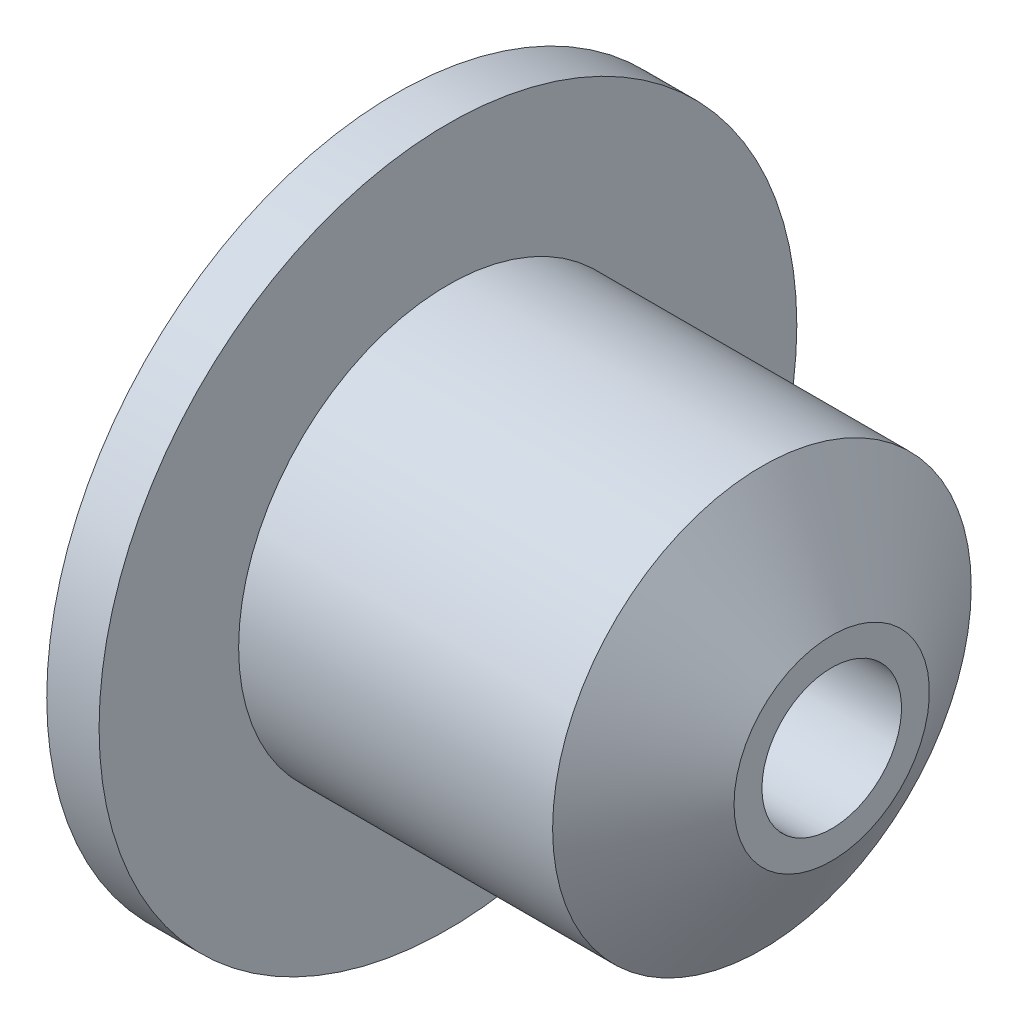
ISO-10303-21;
HEADER;
FILE_DESCRIPTION(('STEP AP214'),'2;1');
FILE_NAME('part.step','',(''),(''),'','','');
FILE_SCHEMA(('AUTOMOTIVE_DESIGN { 1 0 10303 214 1 1 1 1 }'));
ENDSEC;
DATA;
#1=APPLICATION_CONTEXT('core data for automotive mechanical design processes');
#2=APPLICATION_PROTOCOL_DEFINITION('international standard','automotive_design',2000,#1);
#3=PRODUCT_CONTEXT('',#1,'mechanical');
#4=PRODUCT('Part','Part','',(#3));
#5=PRODUCT_RELATED_PRODUCT_CATEGORY('part','',(#4));
#6=PRODUCT_DEFINITION_FORMATION('','',#4);
#7=PRODUCT_DEFINITION_CONTEXT('part definition',#1,'design');
#8=PRODUCT_DEFINITION('design','',#6,#7);
#9=PRODUCT_DEFINITION_SHAPE('','',#8);
#10=(LENGTH_UNIT() NAMED_UNIT(*) SI_UNIT(.MILLI.,.METRE.));
#11=(NAMED_UNIT(*) PLANE_ANGLE_UNIT() SI_UNIT($,.RADIAN.));
#12=(NAMED_UNIT(*) SI_UNIT($,.STERADIAN.) SOLID_ANGLE_UNIT());
#13=UNCERTAINTY_MEASURE_WITH_UNIT(LENGTH_MEASURE(1.E-05),#10,'distance_accuracy_value','');
#14=(GEOMETRIC_REPRESENTATION_CONTEXT(3) GLOBAL_UNCERTAINTY_ASSIGNED_CONTEXT((#13)) GLOBAL_UNIT_ASSIGNED_CONTEXT((#10,
#11,#12)) REPRESENTATION_CONTEXT('',''));
#15=CARTESIAN_POINT('',(0.,0.,0.));
#16=DIRECTION('',(0.,0.,1.));
#17=DIRECTION('',(1.,0.,0.));
#18=AXIS2_PLACEMENT_3D('',#15,#16,#17);
#19=CARTESIAN_POINT('',(-34.9257521150592,1.99999999999999,0.));
#20=DIRECTION('',(1.,0.,0.));
#21=DIRECTION('',(0.,0.,-1.));
#22=AXIS2_PLACEMENT_3D('',#19,#20,#21);
#23=PLANE('',#22);
#24=CARTESIAN_POINT('',(-34.9257521150592,0.,0.));
#25=DIRECTION('',(-1.,0.,0.));
#26=DIRECTION('',(0.,0.,1.));
#27=AXIS2_PLACEMENT_3D('',#24,#25,#26);
#28=CIRCLE('',#27,1.99999999999999);
#29=CARTESIAN_POINT('',(-34.9257521150592,0.,1.99999999999999));
#30=VERTEX_POINT('',#29);
#31=EDGE_CURVE('E10',#30,#30,#28,.T.);
#32=ORIENTED_EDGE('',*,*,#31,.F.);
#33=EDGE_LOOP('',(#32));
#34=FACE_BOUND('',#33,.T.);
#35=CARTESIAN_POINT('',(-34.9257521150592,0.,0.));
#36=DIRECTION('',(-1.,0.,0.));
#37=DIRECTION('',(0.,0.,1.));
#38=AXIS2_PLACEMENT_3D('',#35,#36,#37);
#39=CIRCLE('',#38,10.);
#40=CARTESIAN_POINT('',(-34.9257521150592,0.,10.));
#41=VERTEX_POINT('',#40);
#42=EDGE_CURVE('E36',#41,#41,#39,.T.);
#43=ORIENTED_EDGE('',*,*,#42,.T.);
#44=EDGE_LOOP('',(#43));
#45=FACE_BOUND('',#44,.T.);
#46=ADVANCED_FACE('F30',(#34,#45),#23,.F.);
#47=CARTESIAN_POINT('',(-41.136073604061,0.,0.));
#48=DIRECTION('',(-1.,0.,0.));
#49=DIRECTION('',(0.,0.,1.));
#50=AXIS2_PLACEMENT_3D('',#47,#48,#49);
#51=CYLINDRICAL_SURFACE('',#50,10.);
#52=ORIENTED_EDGE('',*,*,#42,.F.);
#53=EDGE_LOOP('',(#52));
#54=FACE_BOUND('',#53,.T.);
#55=CARTESIAN_POINT('',(-33.4257521150592,0.,0.));
#56=DIRECTION('',(-1.,0.,0.));
#57=DIRECTION('',(0.,0.,1.));
#58=AXIS2_PLACEMENT_3D('',#55,#56,#57);
#59=CIRCLE('',#58,10.);
#60=CARTESIAN_POINT('',(-33.4257521150592,0.,10.));
#61=VERTEX_POINT('',#60);
#62=EDGE_CURVE('E40',#61,#61,#59,.T.);
#63=ORIENTED_EDGE('',*,*,#62,.T.);
#64=EDGE_LOOP('',(#63));
#65=FACE_BOUND('',#64,.T.);
#66=ADVANCED_FACE('F71',(#54,#65),#51,.T.);
#67=CARTESIAN_POINT('',(-33.4257521150592,10.,0.));
#68=DIRECTION('',(-1.,0.,0.));
#69=DIRECTION('',(0.,0.,1.));
#70=AXIS2_PLACEMENT_3D('',#67,#68,#69);
#71=PLANE('',#70);
#72=ORIENTED_EDGE('',*,*,#62,.F.);
#73=EDGE_LOOP('',(#72));
#74=FACE_BOUND('',#73,.T.);
#75=CARTESIAN_POINT('',(-33.4257521150592,0.,0.));
#76=DIRECTION('',(-1.,0.,0.));
#77=DIRECTION('',(0.,0.,1.));
#78=AXIS2_PLACEMENT_3D('',#75,#76,#77);
#79=CIRCLE('',#78,6.);
#80=CARTESIAN_POINT('',(-33.4257521150592,0.,6.));
#81=VERTEX_POINT('',#80);
#82=EDGE_CURVE('E44',#81,#81,#79,.T.);
#83=ORIENTED_EDGE('',*,*,#82,.T.);
#84=EDGE_LOOP('',(#83));
#85=FACE_BOUND('',#84,.T.);
#86=ADVANCED_FACE('F76',(#74,#85),#71,.F.);
#87=CARTESIAN_POINT('',(-41.136073604061,0.,0.));
#88=DIRECTION('',(-1.,0.,0.));
#89=DIRECTION('',(0.,0.,1.));
#90=AXIS2_PLACEMENT_3D('',#87,#88,#89);
#91=CYLINDRICAL_SURFACE('',#90,6.);
#92=ORIENTED_EDGE('',*,*,#82,.F.);
#93=EDGE_LOOP('',(#92));
#94=FACE_BOUND('',#93,.T.);
#95=CARTESIAN_POINT('',(-24.4257521150592,0.,0.));
#96=DIRECTION('',(-1.,0.,0.));
#97=DIRECTION('',(0.,0.,1.));
#98=AXIS2_PLACEMENT_3D('',#95,#96,#97);
#99=CIRCLE('',#98,6.);
#100=CARTESIAN_POINT('',(-24.4257521150592,0.,6.));
#101=VERTEX_POINT('',#100);
#102=EDGE_CURVE('E49',#101,#101,#99,.T.);
#103=ORIENTED_EDGE('',*,*,#102,.T.);
#104=EDGE_LOOP('',(#103));
#105=FACE_BOUND('',#104,.T.);
#106=ADVANCED_FACE('F81',(#94,#105),#91,.T.);
#107=CARTESIAN_POINT('',(-22.4257521150592,0.,0.));
#108=DIRECTION('',(-1.,0.,0.));
#109=DIRECTION('',(0.,0.,1.));
#110=AXIS2_PLACEMENT_3D('',#107,#108,#109);
#111=CONICAL_SURFACE('',#110,2.8,1.01219701145133);
#112=ORIENTED_EDGE('',*,*,#102,.F.);
#113=EDGE_LOOP('',(#112));
#114=FACE_BOUND('',#113,.T.);
#115=CARTESIAN_POINT('',(-22.4257521150592,0.,0.));
#116=DIRECTION('',(-1.,0.,0.));
#117=DIRECTION('',(0.,0.,1.));
#118=AXIS2_PLACEMENT_3D('',#115,#116,#117);
#119=CIRCLE('',#118,2.8);
#120=CARTESIAN_POINT('',(-22.4257521150592,0.,2.8));
#121=VERTEX_POINT('',#120);
#122=EDGE_CURVE('E52',#121,#121,#119,.T.);
#123=ORIENTED_EDGE('',*,*,#122,.T.);
#124=EDGE_LOOP('',(#123));
#125=FACE_BOUND('',#124,.T.);
#126=ADVANCED_FACE('F67',(#114,#125),#111,.T.);
#127=CARTESIAN_POINT('',(-22.4257521150592,2.,0.));
#128=DIRECTION('',(-1.,0.,0.));
#129=DIRECTION('',(0.,0.,1.));
#130=AXIS2_PLACEMENT_3D('',#127,#128,#129);
#131=PLANE('',#130);
#132=ORIENTED_EDGE('',*,*,#122,.F.);
#133=EDGE_LOOP('',(#132));
#134=FACE_BOUND('',#133,.T.);
#135=CARTESIAN_POINT('',(-22.4257521150592,0.,0.));
#136=DIRECTION('',(-1.,0.,0.));
#137=DIRECTION('',(0.,0.,1.));
#138=AXIS2_PLACEMENT_3D('',#135,#136,#137);
#139=CIRCLE('',#138,2.);
#140=CARTESIAN_POINT('',(-22.4257521150592,0.,2.));
#141=VERTEX_POINT('',#140);
#142=EDGE_CURVE('E55',#141,#141,#139,.T.);
#143=ORIENTED_EDGE('',*,*,#142,.T.);
#144=EDGE_LOOP('',(#143));
#145=FACE_BOUND('',#144,.T.);
#146=ADVANCED_FACE('F59',(#134,#145),#131,.F.);
#147=CARTESIAN_POINT('',(-41.136073604061,0.,0.));
#148=DIRECTION('',(-1.,0.,0.));
#149=DIRECTION('',(0.,0.,1.));
#150=AXIS2_PLACEMENT_3D('',#147,#148,#149);
#151=CYLINDRICAL_SURFACE('',#150,2.);
#152=ORIENTED_EDGE('',*,*,#142,.F.);
#153=EDGE_LOOP('',(#152));
#154=FACE_BOUND('',#153,.T.);
#155=ORIENTED_EDGE('',*,*,#31,.T.);
#156=EDGE_LOOP('',(#155));
#157=FACE_BOUND('',#156,.T.);
#158=ADVANCED_FACE('F61',(#154,#157),#151,.F.);
#159=CLOSED_SHELL('',(#46,#66,#86,#106,#126,#146,#158));
#160=MANIFOLD_SOLID_BREP('B2',#159);
#161=ADVANCED_BREP_SHAPE_REPRESENTATION('',(#18,#160),#14);
#162=SHAPE_DEFINITION_REPRESENTATION(#9,#161);
ENDSEC;
END-ISO-10303-21;
